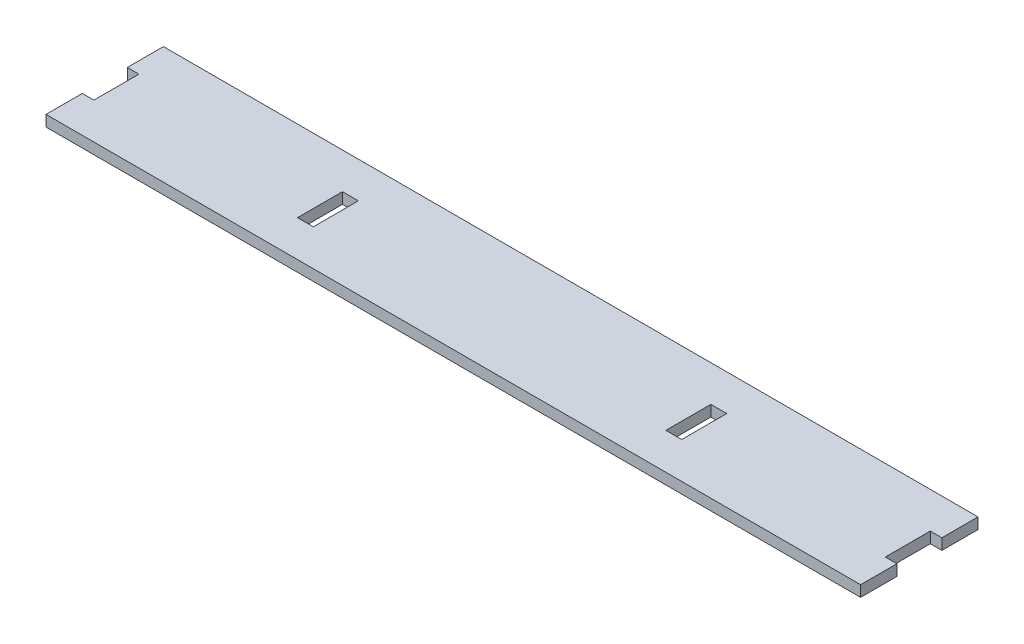
ISO-10303-21;
HEADER;
FILE_DESCRIPTION(('STEP AP214'),'2;1');
FILE_NAME('part.step','',(''),(''),'','','');
FILE_SCHEMA(('AUTOMOTIVE_DESIGN { 1 0 10303 214 1 1 1 1 }'));
ENDSEC;
DATA;
#1=APPLICATION_CONTEXT('core data for automotive mechanical design processes');
#2=APPLICATION_PROTOCOL_DEFINITION('international standard','automotive_design',2000,#1);
#3=PRODUCT_CONTEXT('',#1,'mechanical');
#4=PRODUCT('Part','Part','',(#3));
#5=PRODUCT_RELATED_PRODUCT_CATEGORY('part','',(#4));
#6=PRODUCT_DEFINITION_FORMATION('','',#4);
#7=PRODUCT_DEFINITION_CONTEXT('part definition',#1,'design');
#8=PRODUCT_DEFINITION('design','',#6,#7);
#9=PRODUCT_DEFINITION_SHAPE('','',#8);
#10=(LENGTH_UNIT() NAMED_UNIT(*) SI_UNIT(.MILLI.,.METRE.));
#11=(NAMED_UNIT(*) PLANE_ANGLE_UNIT() SI_UNIT($,.RADIAN.));
#12=(NAMED_UNIT(*) SI_UNIT($,.STERADIAN.) SOLID_ANGLE_UNIT());
#13=UNCERTAINTY_MEASURE_WITH_UNIT(LENGTH_MEASURE(1.E-05),#10,'distance_accuracy_value','');
#14=(GEOMETRIC_REPRESENTATION_CONTEXT(3) GLOBAL_UNCERTAINTY_ASSIGNED_CONTEXT((#13)) GLOBAL_UNIT_ASSIGNED_CONTEXT((#10,
#11,#12)) REPRESENTATION_CONTEXT('',''));
#15=CARTESIAN_POINT('',(0.,0.,0.));
#16=DIRECTION('',(0.,0.,1.));
#17=DIRECTION('',(1.,0.,0.));
#18=AXIS2_PLACEMENT_3D('',#15,#16,#17);
#19=CARTESIAN_POINT('',(-177.8,4.7625,25.4));
#20=DIRECTION('',(0.,0.,-1.));
#21=DIRECTION('',(-1.,0.,0.));
#22=AXIS2_PLACEMENT_3D('',#19,#20,#21);
#23=PLANE('',#22);
#24=DIRECTION('',(1.,0.,0.));
#25=VECTOR('',#24,1.);
#26=CARTESIAN_POINT('',(-177.8,0.,25.4));
#27=LINE('',#26,#25);
#28=CARTESIAN_POINT('',(-176.2125,0.,25.4));
#29=VERTEX_POINT('',#28);
#30=CARTESIAN_POINT('',(176.2125,0.,25.4));
#31=VERTEX_POINT('',#30);
#32=EDGE_CURVE('E271',#29,#31,#27,.T.);
#33=ORIENTED_EDGE('',*,*,#32,.T.);
#34=DIRECTION('',(0.,1.,0.));
#35=VECTOR('',#34,1.);
#36=CARTESIAN_POINT('',(176.2125,0.,25.4));
#37=LINE('',#36,#35);
#38=CARTESIAN_POINT('',(176.2125,4.7625,25.4));
#39=VERTEX_POINT('',#38);
#40=EDGE_CURVE('E247',#31,#39,#37,.T.);
#41=ORIENTED_EDGE('',*,*,#40,.T.);
#42=DIRECTION('',(1.,0.,0.));
#43=VECTOR('',#42,1.);
#44=CARTESIAN_POINT('',(-177.8,4.7625,25.4));
#45=LINE('',#44,#43);
#46=CARTESIAN_POINT('',(-176.2125,4.7625,25.4));
#47=VERTEX_POINT('',#46);
#48=EDGE_CURVE('E293',#47,#39,#45,.T.);
#49=ORIENTED_EDGE('',*,*,#48,.F.);
#50=DIRECTION('',(0.,1.,0.));
#51=VECTOR('',#50,1.);
#52=CARTESIAN_POINT('',(-176.2125,0.,25.4));
#53=LINE('',#52,#51);
#54=EDGE_CURVE('E266',#29,#47,#53,.T.);
#55=ORIENTED_EDGE('',*,*,#54,.F.);
#56=EDGE_LOOP('',(#33,#41,#49,#55));
#57=FACE_BOUND('',#56,.T.);
#58=ADVANCED_FACE('F35',(#57),#23,.F.);
#59=CARTESIAN_POINT('',(-177.8,4.7625,-25.4));
#60=DIRECTION('',(0.,0.,1.));
#61=DIRECTION('',(1.,0.,0.));
#62=AXIS2_PLACEMENT_3D('',#59,#60,#61);
#63=PLANE('',#62);
#64=DIRECTION('',(-1.,0.,0.));
#65=VECTOR('',#64,1.);
#66=CARTESIAN_POINT('',(-177.8,4.7625,-25.4));
#67=LINE('',#66,#65);
#68=CARTESIAN_POINT('',(176.2125,4.7625,-25.4));
#69=VERTEX_POINT('',#68);
#70=CARTESIAN_POINT('',(-176.2125,4.7625,-25.4));
#71=VERTEX_POINT('',#70);
#72=EDGE_CURVE('E287',#69,#71,#67,.T.);
#73=ORIENTED_EDGE('',*,*,#72,.F.);
#74=DIRECTION('',(0.,1.,0.));
#75=VECTOR('',#74,1.);
#76=CARTESIAN_POINT('',(176.2125,0.,-25.4));
#77=LINE('',#76,#75);
#78=CARTESIAN_POINT('',(176.2125,0.,-25.4));
#79=VERTEX_POINT('',#78);
#80=EDGE_CURVE('E235',#79,#69,#77,.T.);
#81=ORIENTED_EDGE('',*,*,#80,.F.);
#82=DIRECTION('',(-1.,0.,0.));
#83=VECTOR('',#82,1.);
#84=CARTESIAN_POINT('',(-177.8,0.,-25.4));
#85=LINE('',#84,#83);
#86=CARTESIAN_POINT('',(-176.2125,0.,-25.4));
#87=VERTEX_POINT('',#86);
#88=EDGE_CURVE('E311',#79,#87,#85,.T.);
#89=ORIENTED_EDGE('',*,*,#88,.T.);
#90=DIRECTION('',(0.,1.,0.));
#91=VECTOR('',#90,1.);
#92=CARTESIAN_POINT('',(-176.2125,0.,-25.4));
#93=LINE('',#92,#91);
#94=EDGE_CURVE('E258',#87,#71,#93,.T.);
#95=ORIENTED_EDGE('',*,*,#94,.T.);
#96=EDGE_LOOP('',(#73,#81,#89,#95));
#97=FACE_BOUND('',#96,.T.);
#98=ADVANCED_FACE('F350',(#97),#63,.F.);
#99=CARTESIAN_POINT('',(0.,4.7625,0.));
#100=DIRECTION('',(0.,1.,0.));
#101=DIRECTION('',(0.,0.,1.));
#102=AXIS2_PLACEMENT_3D('',#99,#100,#101);
#103=PLANE('',#102);
#104=DIRECTION('',(1.,0.,0.));
#105=VECTOR('',#104,1.);
#106=CARTESIAN_POINT('',(82.8039999999999,4.7625,-9.77900000000513));
#107=LINE('',#106,#105);
#108=CARTESIAN_POINT('',(76.2634999999999,4.7625,-9.77900000000513));
#109=VERTEX_POINT('',#108);
#110=CARTESIAN_POINT('',(83.1214999999999,4.7625,-9.77900000000515));
#111=VERTEX_POINT('',#110);
#112=EDGE_CURVE('E52',#109,#111,#107,.T.);
#113=ORIENTED_EDGE('',*,*,#112,.T.);
#114=DIRECTION('',(0.,0.,-1.));
#115=VECTOR('',#114,1.);
#116=CARTESIAN_POINT('',(83.1214999999999,4.7625,-9.77900000000515));
#117=LINE('',#116,#115);
#118=CARTESIAN_POINT('',(83.1214999999999,4.7625,9.6923213213589));
#119=VERTEX_POINT('',#118);
#120=EDGE_CURVE('E196',#119,#111,#117,.T.);
#121=ORIENTED_EDGE('',*,*,#120,.F.);
#122=DIRECTION('',(-1.,0.,0.));
#123=VECTOR('',#122,1.);
#124=CARTESIAN_POINT('',(82.8039999999999,4.7625,9.6923213213589));
#125=LINE('',#124,#123);
#126=CARTESIAN_POINT('',(76.2634999999999,4.7625,9.6923213213589));
#127=VERTEX_POINT('',#126);
#128=EDGE_CURVE('E188',#119,#127,#125,.T.);
#129=ORIENTED_EDGE('',*,*,#128,.T.);
#130=DIRECTION('',(0.,0.,-1.));
#131=VECTOR('',#130,1.);
#132=CARTESIAN_POINT('',(76.2634999999999,4.7625,-9.77900000000513));
#133=LINE('',#132,#131);
#134=EDGE_CURVE('E211',#127,#109,#133,.T.);
#135=ORIENTED_EDGE('',*,*,#134,.T.);
#136=EDGE_LOOP('',(#113,#121,#129,#135));
#137=FACE_BOUND('',#136,.T.);
#138=DIRECTION('',(-1.,0.,0.));
#139=VECTOR('',#138,1.);
#140=CARTESIAN_POINT('',(-75.9460000000001,4.7625,9.6923213213589));
#141=LINE('',#140,#139);
#142=CARTESIAN_POINT('',(-76.2635000000001,4.7625,9.6923213213589));
#143=VERTEX_POINT('',#142);
#144=CARTESIAN_POINT('',(-83.1215000000001,4.7625,9.6923213213589));
#145=VERTEX_POINT('',#144);
#146=EDGE_CURVE('E277',#143,#145,#141,.T.);
#147=ORIENTED_EDGE('',*,*,#146,.T.);
#148=DIRECTION('',(0.,0.,1.));
#149=VECTOR('',#148,1.);
#150=CARTESIAN_POINT('',(-83.1215000000001,4.7625,-9.77900000000513));
#151=LINE('',#150,#149);
#152=CARTESIAN_POINT('',(-83.1215000000001,4.7625,-9.77900000000513));
#153=VERTEX_POINT('',#152);
#154=EDGE_CURVE('E200',#153,#145,#151,.T.);
#155=ORIENTED_EDGE('',*,*,#154,.F.);
#156=DIRECTION('',(1.,0.,0.));
#157=VECTOR('',#156,1.);
#158=CARTESIAN_POINT('',(-75.9460000000001,4.7625,-9.77900000000513));
#159=LINE('',#158,#157);
#160=CARTESIAN_POINT('',(-76.2635000000001,4.7625,-9.77900000000513));
#161=VERTEX_POINT('',#160);
#162=EDGE_CURVE('E281',#153,#161,#159,.T.);
#163=ORIENTED_EDGE('',*,*,#162,.T.);
#164=DIRECTION('',(0.,0.,1.));
#165=VECTOR('',#164,1.);
#166=CARTESIAN_POINT('',(-76.2635000000001,4.7625,-9.77900000000513));
#167=LINE('',#166,#165);
#168=EDGE_CURVE('E215',#161,#143,#167,.T.);
#169=ORIENTED_EDGE('',*,*,#168,.T.);
#170=EDGE_LOOP('',(#147,#155,#163,#169));
#171=FACE_BOUND('',#170,.T.);
#172=DIRECTION('',(0.,0.,1.));
#173=VECTOR('',#172,1.);
#174=CARTESIAN_POINT('',(176.2125,4.7625,0.));
#175=LINE('',#174,#173);
#176=CARTESIAN_POINT('',(176.2125,4.7625,-9.77900000000509));
#177=VERTEX_POINT('',#176);
#178=EDGE_CURVE('E224',#69,#177,#175,.T.);
#179=ORIENTED_EDGE('',*,*,#178,.F.);
#180=ORIENTED_EDGE('',*,*,#72,.T.);
#181=DIRECTION('',(0.,0.,-1.));
#182=VECTOR('',#181,1.);
#183=CARTESIAN_POINT('',(-176.2125,4.7625,0.));
#184=LINE('',#183,#182);
#185=CARTESIAN_POINT('',(-176.2125,4.7625,-9.77900000000513));
#186=VERTEX_POINT('',#185);
#187=EDGE_CURVE('E250',#186,#71,#184,.T.);
#188=ORIENTED_EDGE('',*,*,#187,.F.);
#189=DIRECTION('',(1.,0.,0.));
#190=VECTOR('',#189,1.);
#191=CARTESIAN_POINT('',(-171.196,4.7625,-9.77900000000513));
#192=LINE('',#191,#190);
#193=CARTESIAN_POINT('',(-171.196,4.7625,-9.77900000000513));
#194=VERTEX_POINT('',#193);
#195=EDGE_CURVE('E284',#186,#194,#192,.T.);
#196=ORIENTED_EDGE('',*,*,#195,.T.);
#197=DIRECTION('',(0.,0.,1.));
#198=VECTOR('',#197,1.);
#199=CARTESIAN_POINT('',(-171.196,4.7625,-9.77900000000513));
#200=LINE('',#199,#198);
#201=CARTESIAN_POINT('',(-171.196,4.7625,9.69232132137164));
#202=VERTEX_POINT('',#201);
#203=EDGE_CURVE('E286',#194,#202,#200,.T.);
#204=ORIENTED_EDGE('',*,*,#203,.T.);
#205=DIRECTION('',(-1.,0.,0.));
#206=VECTOR('',#205,1.);
#207=CARTESIAN_POINT('',(-171.196,4.7625,9.69232132137164));
#208=LINE('',#207,#206);
#209=CARTESIAN_POINT('',(-176.2125,4.7625,9.69232132137164));
#210=VERTEX_POINT('',#209);
#211=EDGE_CURVE('E290',#202,#210,#208,.T.);
#212=ORIENTED_EDGE('',*,*,#211,.T.);
#213=DIRECTION('',(0.,0.,-1.));
#214=VECTOR('',#213,1.);
#215=CARTESIAN_POINT('',(-176.2125,4.7625,0.));
#216=LINE('',#215,#214);
#217=EDGE_CURVE('E261',#47,#210,#216,.T.);
#218=ORIENTED_EDGE('',*,*,#217,.F.);
#219=ORIENTED_EDGE('',*,*,#48,.T.);
#220=DIRECTION('',(0.,0.,1.));
#221=VECTOR('',#220,1.);
#222=CARTESIAN_POINT('',(176.2125,4.7625,0.));
#223=LINE('',#222,#221);
#224=CARTESIAN_POINT('',(176.2125,4.7625,9.6923213213589));
#225=VERTEX_POINT('',#224);
#226=EDGE_CURVE('E240',#225,#39,#223,.T.);
#227=ORIENTED_EDGE('',*,*,#226,.F.);
#228=DIRECTION('',(-1.,0.,0.));
#229=VECTOR('',#228,1.);
#230=CARTESIAN_POINT('',(171.196,4.7625,9.6923213213589));
#231=LINE('',#230,#229);
#232=CARTESIAN_POINT('',(171.196,4.7625,9.6923213213589));
#233=VERTEX_POINT('',#232);
#234=EDGE_CURVE('E307',#225,#233,#231,.T.);
#235=ORIENTED_EDGE('',*,*,#234,.T.);
#236=DIRECTION('',(0.,0.,-1.));
#237=VECTOR('',#236,1.);
#238=CARTESIAN_POINT('',(171.196,4.7625,-9.77900000000509));
#239=LINE('',#238,#237);
#240=CARTESIAN_POINT('',(171.196,4.7625,-9.77900000000509));
#241=VERTEX_POINT('',#240);
#242=EDGE_CURVE('E279',#233,#241,#239,.T.);
#243=ORIENTED_EDGE('',*,*,#242,.T.);
#244=DIRECTION('',(1.,0.,0.));
#245=VECTOR('',#244,1.);
#246=CARTESIAN_POINT('',(171.196,4.7625,-9.77900000000509));
#247=LINE('',#246,#245);
#248=EDGE_CURVE('E39',#241,#177,#247,.T.);
#249=ORIENTED_EDGE('',*,*,#248,.T.);
#250=EDGE_LOOP('',(#179,#180,#188,#196,#204,#212,#218,#219,#227,#235,#243,#249));
#251=FACE_BOUND('',#250,.T.);
#252=ADVANCED_FACE('F332',(#137,#171,#251),#103,.T.);
#253=CARTESIAN_POINT('',(0.,0.,0.));
#254=DIRECTION('',(0.,1.,0.));
#255=DIRECTION('',(0.,0.,1.));
#256=AXIS2_PLACEMENT_3D('',#253,#254,#255);
#257=PLANE('',#256);
#258=DIRECTION('',(0.,0.,-1.));
#259=VECTOR('',#258,1.);
#260=CARTESIAN_POINT('',(83.1214999999999,0.,-9.77900000000515));
#261=LINE('',#260,#259);
#262=CARTESIAN_POINT('',(83.1214999999999,0.,9.6923213213589));
#263=VERTEX_POINT('',#262);
#264=CARTESIAN_POINT('',(83.1214999999999,0.,-9.77900000000515));
#265=VERTEX_POINT('',#264);
#266=EDGE_CURVE('E176',#263,#265,#261,.T.);
#267=ORIENTED_EDGE('',*,*,#266,.T.);
#268=DIRECTION('',(1.,0.,0.));
#269=VECTOR('',#268,1.);
#270=CARTESIAN_POINT('',(82.8039999999999,0.,-9.77900000000513));
#271=LINE('',#270,#269);
#272=CARTESIAN_POINT('',(76.2634999999999,0.,-9.77900000000513));
#273=VERTEX_POINT('',#272);
#274=EDGE_CURVE('E182',#273,#265,#271,.T.);
#275=ORIENTED_EDGE('',*,*,#274,.F.);
#276=DIRECTION('',(0.,0.,1.));
#277=VECTOR('',#276,1.);
#278=CARTESIAN_POINT('',(76.2634999999999,0.,-9.77900000000513));
#279=LINE('',#278,#277);
#280=CARTESIAN_POINT('',(76.2634999999999,0.,9.6923213213589));
#281=VERTEX_POINT('',#280);
#282=EDGE_CURVE('E178',#273,#281,#279,.T.);
#283=ORIENTED_EDGE('',*,*,#282,.T.);
#284=DIRECTION('',(-1.,0.,0.));
#285=VECTOR('',#284,1.);
#286=CARTESIAN_POINT('',(82.8039999999999,0.,9.6923213213589));
#287=LINE('',#286,#285);
#288=EDGE_CURVE('E172',#263,#281,#287,.T.);
#289=ORIENTED_EDGE('',*,*,#288,.F.);
#290=EDGE_LOOP('',(#267,#275,#283,#289));
#291=FACE_BOUND('',#290,.T.);
#292=DIRECTION('',(0.,0.,1.));
#293=VECTOR('',#292,1.);
#294=CARTESIAN_POINT('',(-83.1215000000001,0.,-9.77900000000513));
#295=LINE('',#294,#293);
#296=CARTESIAN_POINT('',(-83.1215000000001,0.,-9.77900000000513));
#297=VERTEX_POINT('',#296);
#298=CARTESIAN_POINT('',(-83.1215000000001,0.,9.6923213213589));
#299=VERTEX_POINT('',#298);
#300=EDGE_CURVE('E202',#297,#299,#295,.T.);
#301=ORIENTED_EDGE('',*,*,#300,.T.);
#302=DIRECTION('',(-1.,0.,0.));
#303=VECTOR('',#302,1.);
#304=CARTESIAN_POINT('',(-75.9460000000001,0.,9.6923213213589));
#305=LINE('',#304,#303);
#306=CARTESIAN_POINT('',(-76.2635000000001,0.,9.6923213213589));
#307=VERTEX_POINT('',#306);
#308=EDGE_CURVE('E282',#307,#299,#305,.T.);
#309=ORIENTED_EDGE('',*,*,#308,.F.);
#310=DIRECTION('',(0.,0.,-1.));
#311=VECTOR('',#310,1.);
#312=CARTESIAN_POINT('',(-76.2635000000001,0.,-9.77900000000513));
#313=LINE('',#312,#311);
#314=CARTESIAN_POINT('',(-76.2635000000001,0.,-9.77900000000513));
#315=VERTEX_POINT('',#314);
#316=EDGE_CURVE('E221',#307,#315,#313,.T.);
#317=ORIENTED_EDGE('',*,*,#316,.T.);
#318=DIRECTION('',(1.,0.,0.));
#319=VECTOR('',#318,1.);
#320=CARTESIAN_POINT('',(-75.9460000000001,0.,-9.77900000000513));
#321=LINE('',#320,#319);
#322=EDGE_CURVE('E304',#297,#315,#321,.T.);
#323=ORIENTED_EDGE('',*,*,#322,.F.);
#324=EDGE_LOOP('',(#301,#309,#317,#323));
#325=FACE_BOUND('',#324,.T.);
#326=ORIENTED_EDGE('',*,*,#88,.F.);
#327=DIRECTION('',(0.,0.,1.));
#328=VECTOR('',#327,1.);
#329=CARTESIAN_POINT('',(176.2125,0.,0.));
#330=LINE('',#329,#328);
#331=CARTESIAN_POINT('',(176.2125,0.,-9.77900000000509));
#332=VERTEX_POINT('',#331);
#333=EDGE_CURVE('E232',#79,#332,#330,.T.);
#334=ORIENTED_EDGE('',*,*,#333,.T.);
#335=DIRECTION('',(1.,0.,0.));
#336=VECTOR('',#335,1.);
#337=CARTESIAN_POINT('',(171.196,0.,-9.77900000000509));
#338=LINE('',#337,#336);
#339=CARTESIAN_POINT('',(171.196,0.,-9.77900000000509));
#340=VERTEX_POINT('',#339);
#341=EDGE_CURVE('E321',#340,#332,#338,.T.);
#342=ORIENTED_EDGE('',*,*,#341,.F.);
#343=DIRECTION('',(0.,0.,-1.));
#344=VECTOR('',#343,1.);
#345=CARTESIAN_POINT('',(171.196,0.,-9.77900000000509));
#346=LINE('',#345,#344);
#347=CARTESIAN_POINT('',(171.196,0.,9.6923213213589));
#348=VERTEX_POINT('',#347);
#349=EDGE_CURVE('E44',#348,#340,#346,.T.);
#350=ORIENTED_EDGE('',*,*,#349,.F.);
#351=DIRECTION('',(1.,0.,0.));
#352=VECTOR('',#351,1.);
#353=CARTESIAN_POINT('',(0.,0.,9.69232132135886));
#354=LINE('',#353,#352);
#355=CARTESIAN_POINT('',(176.2125,0.,9.6923213213589));
#356=VERTEX_POINT('',#355);
#357=EDGE_CURVE('E273',#348,#356,#354,.T.);
#358=ORIENTED_EDGE('',*,*,#357,.T.);
#359=DIRECTION('',(0.,0.,1.));
#360=VECTOR('',#359,1.);
#361=CARTESIAN_POINT('',(176.2125,0.,0.));
#362=LINE('',#361,#360);
#363=EDGE_CURVE('E242',#356,#31,#362,.T.);
#364=ORIENTED_EDGE('',*,*,#363,.T.);
#365=ORIENTED_EDGE('',*,*,#32,.F.);
#366=DIRECTION('',(0.,0.,-1.));
#367=VECTOR('',#366,1.);
#368=CARTESIAN_POINT('',(-176.2125,0.,0.));
#369=LINE('',#368,#367);
#370=CARTESIAN_POINT('',(-176.2125,0.,9.69232132137164));
#371=VERTEX_POINT('',#370);
#372=EDGE_CURVE('E263',#29,#371,#369,.T.);
#373=ORIENTED_EDGE('',*,*,#372,.T.);
#374=DIRECTION('',(-1.,0.,0.));
#375=VECTOR('',#374,1.);
#376=CARTESIAN_POINT('',(-171.196,0.,9.69232132137164));
#377=LINE('',#376,#375);
#378=CARTESIAN_POINT('',(-171.196,0.,9.69232132137164));
#379=VERTEX_POINT('',#378);
#380=EDGE_CURVE('E298',#379,#371,#377,.T.);
#381=ORIENTED_EDGE('',*,*,#380,.F.);
#382=DIRECTION('',(0.,0.,1.));
#383=VECTOR('',#382,1.);
#384=CARTESIAN_POINT('',(-171.196,0.,-9.77900000000513));
#385=LINE('',#384,#383);
#386=CARTESIAN_POINT('',(-171.196,0.,-9.77900000000513));
#387=VERTEX_POINT('',#386);
#388=EDGE_CURVE('E294',#387,#379,#385,.T.);
#389=ORIENTED_EDGE('',*,*,#388,.F.);
#390=DIRECTION('',(-1.,0.,0.));
#391=VECTOR('',#390,1.);
#392=CARTESIAN_POINT('',(0.,0.,-9.77900000000513));
#393=LINE('',#392,#391);
#394=CARTESIAN_POINT('',(-176.2125,0.,-9.77900000000513));
#395=VERTEX_POINT('',#394);
#396=EDGE_CURVE('E276',#387,#395,#393,.T.);
#397=ORIENTED_EDGE('',*,*,#396,.T.);
#398=DIRECTION('',(0.,0.,-1.));
#399=VECTOR('',#398,1.);
#400=CARTESIAN_POINT('',(-176.2125,0.,0.));
#401=LINE('',#400,#399);
#402=EDGE_CURVE('E252',#395,#87,#401,.T.);
#403=ORIENTED_EDGE('',*,*,#402,.T.);
#404=EDGE_LOOP('',(#326,#334,#342,#350,#358,#364,#365,#373,#381,#389,#397,#403));
#405=FACE_BOUND('',#404,.T.);
#406=ADVANCED_FACE('F37',(#291,#325,#405),#257,.F.);
#407=CARTESIAN_POINT('',(-171.196,4.7625,-9.77900000000513));
#408=DIRECTION('',(0.,0.,-1.));
#409=DIRECTION('',(-1.,0.,0.));
#410=AXIS2_PLACEMENT_3D('',#407,#408,#409);
#411=PLANE('',#410);
#412=ORIENTED_EDGE('',*,*,#195,.F.);
#413=DIRECTION('',(0.,1.,0.));
#414=VECTOR('',#413,1.);
#415=CARTESIAN_POINT('',(-176.2125,0.,-9.77900000000513));
#416=LINE('',#415,#414);
#417=EDGE_CURVE('E255',#395,#186,#416,.T.);
#418=ORIENTED_EDGE('',*,*,#417,.F.);
#419=ORIENTED_EDGE('',*,*,#396,.F.);
#420=DIRECTION('',(0.,-1.,0.));
#421=VECTOR('',#420,1.);
#422=CARTESIAN_POINT('',(-171.196,4.7625,-9.77900000000513));
#423=LINE('',#422,#421);
#424=EDGE_CURVE('E297',#194,#387,#423,.T.);
#425=ORIENTED_EDGE('',*,*,#424,.F.);
#426=EDGE_LOOP('',(#412,#418,#419,#425));
#427=FACE_BOUND('',#426,.T.);
#428=ADVANCED_FACE('F363',(#427),#411,.F.);
#429=CARTESIAN_POINT('',(-171.196,4.7625,9.69232132137164));
#430=DIRECTION('',(0.,0.,1.));
#431=DIRECTION('',(1.,0.,0.));
#432=AXIS2_PLACEMENT_3D('',#429,#430,#431);
#433=PLANE('',#432);
#434=ORIENTED_EDGE('',*,*,#380,.T.);
#435=DIRECTION('',(0.,1.,0.));
#436=VECTOR('',#435,1.);
#437=CARTESIAN_POINT('',(-176.2125,0.,9.69232132137164));
#438=LINE('',#437,#436);
#439=EDGE_CURVE('E268',#371,#210,#438,.T.);
#440=ORIENTED_EDGE('',*,*,#439,.T.);
#441=ORIENTED_EDGE('',*,*,#211,.F.);
#442=DIRECTION('',(0.,-1.,0.));
#443=VECTOR('',#442,1.);
#444=CARTESIAN_POINT('',(-171.196,4.7625,9.69232132137164));
#445=LINE('',#444,#443);
#446=EDGE_CURVE('E301',#202,#379,#445,.T.);
#447=ORIENTED_EDGE('',*,*,#446,.T.);
#448=EDGE_LOOP('',(#434,#440,#441,#447));
#449=FACE_BOUND('',#448,.T.);
#450=ADVANCED_FACE('F370',(#449),#433,.F.);
#451=CARTESIAN_POINT('',(-171.196,4.7625,-9.77900000000513));
#452=DIRECTION('',(1.,0.,0.));
#453=DIRECTION('',(0.,0.,-1.));
#454=AXIS2_PLACEMENT_3D('',#451,#452,#453);
#455=PLANE('',#454);
#456=ORIENTED_EDGE('',*,*,#388,.T.);
#457=ORIENTED_EDGE('',*,*,#446,.F.);
#458=ORIENTED_EDGE('',*,*,#203,.F.);
#459=ORIENTED_EDGE('',*,*,#424,.T.);
#460=EDGE_LOOP('',(#456,#457,#458,#459));
#461=FACE_BOUND('',#460,.T.);
#462=ADVANCED_FACE('F368',(#461),#455,.F.);
#463=CARTESIAN_POINT('',(-75.9460000000001,4.7625,-9.77900000000513));
#464=DIRECTION('',(0.,0.,-1.));
#465=DIRECTION('',(-1.,0.,0.));
#466=AXIS2_PLACEMENT_3D('',#463,#464,#465);
#467=PLANE('',#466);
#468=ORIENTED_EDGE('',*,*,#322,.T.);
#469=DIRECTION('',(0.,1.,0.));
#470=VECTOR('',#469,1.);
#471=CARTESIAN_POINT('',(-76.2635000000001,-19.4739097319928,-9.77900000000513));
#472=LINE('',#471,#470);
#473=EDGE_CURVE('E228',#315,#161,#472,.T.);
#474=ORIENTED_EDGE('',*,*,#473,.T.);
#475=ORIENTED_EDGE('',*,*,#162,.F.);
#476=DIRECTION('',(0.,1.,0.));
#477=VECTOR('',#476,1.);
#478=CARTESIAN_POINT('',(-83.1215000000001,0.,-9.77900000000513));
#479=LINE('',#478,#477);
#480=EDGE_CURVE('E205',#297,#153,#479,.T.);
#481=ORIENTED_EDGE('',*,*,#480,.F.);
#482=EDGE_LOOP('',(#468,#474,#475,#481));
#483=FACE_BOUND('',#482,.T.);
#484=ADVANCED_FACE('F400',(#483),#467,.F.);
#485=CARTESIAN_POINT('',(-75.9460000000001,4.7625,9.6923213213589));
#486=DIRECTION('',(0.,0.,1.));
#487=DIRECTION('',(1.,0.,0.));
#488=AXIS2_PLACEMENT_3D('',#485,#486,#487);
#489=PLANE('',#488);
#490=ORIENTED_EDGE('',*,*,#146,.F.);
#491=DIRECTION('',(0.,1.,0.));
#492=VECTOR('',#491,1.);
#493=CARTESIAN_POINT('',(-76.2635000000001,-19.4739097319928,9.6923213213589));
#494=LINE('',#493,#492);
#495=EDGE_CURVE('E225',#307,#143,#494,.T.);
#496=ORIENTED_EDGE('',*,*,#495,.F.);
#497=ORIENTED_EDGE('',*,*,#308,.T.);
#498=DIRECTION('',(0.,1.,0.));
#499=VECTOR('',#498,1.);
#500=CARTESIAN_POINT('',(-83.1215000000001,0.,9.6923213213589));
#501=LINE('',#500,#499);
#502=EDGE_CURVE('E208',#299,#145,#501,.T.);
#503=ORIENTED_EDGE('',*,*,#502,.T.);
#504=EDGE_LOOP('',(#490,#496,#497,#503));
#505=FACE_BOUND('',#504,.T.);
#506=ADVANCED_FACE('F403',(#505),#489,.F.);
#507=CARTESIAN_POINT('',(82.8039999999999,4.7625,-9.77900000000513));
#508=DIRECTION('',(0.,0.,-1.));
#509=DIRECTION('',(-1.,0.,0.));
#510=AXIS2_PLACEMENT_3D('',#507,#508,#509);
#511=PLANE('',#510);
#512=ORIENTED_EDGE('',*,*,#112,.F.);
#513=DIRECTION('',(0.,1.,0.));
#514=VECTOR('',#513,1.);
#515=CARTESIAN_POINT('',(76.2634999999999,-19.4739097319928,-9.77900000000513));
#516=LINE('',#515,#514);
#517=EDGE_CURVE('E56',#273,#109,#516,.T.);
#518=ORIENTED_EDGE('',*,*,#517,.F.);
#519=ORIENTED_EDGE('',*,*,#274,.T.);
#520=DIRECTION('',(0.,1.,0.));
#521=VECTOR('',#520,1.);
#522=CARTESIAN_POINT('',(83.1214999999999,0.,-9.77900000000515));
#523=LINE('',#522,#521);
#524=EDGE_CURVE('E192',#265,#111,#523,.T.);
#525=ORIENTED_EDGE('',*,*,#524,.T.);
#526=EDGE_LOOP('',(#512,#518,#519,#525));
#527=FACE_BOUND('',#526,.T.);
#528=ADVANCED_FACE('F407',(#527),#511,.F.);
#529=CARTESIAN_POINT('',(82.8039999999999,4.7625,9.6923213213589));
#530=DIRECTION('',(0.,0.,1.));
#531=DIRECTION('',(1.,0.,0.));
#532=AXIS2_PLACEMENT_3D('',#529,#530,#531);
#533=PLANE('',#532);
#534=ORIENTED_EDGE('',*,*,#288,.T.);
#535=DIRECTION('',(0.,1.,0.));
#536=VECTOR('',#535,1.);
#537=CARTESIAN_POINT('',(76.2634999999999,-19.4739097319928,9.6923213213589));
#538=LINE('',#537,#536);
#539=EDGE_CURVE('E218',#281,#127,#538,.T.);
#540=ORIENTED_EDGE('',*,*,#539,.T.);
#541=ORIENTED_EDGE('',*,*,#128,.F.);
#542=DIRECTION('',(0.,1.,0.));
#543=VECTOR('',#542,1.);
#544=CARTESIAN_POINT('',(83.1214999999999,0.,9.6923213213589));
#545=LINE('',#544,#543);
#546=EDGE_CURVE('E185',#263,#119,#545,.T.);
#547=ORIENTED_EDGE('',*,*,#546,.F.);
#548=EDGE_LOOP('',(#534,#540,#541,#547));
#549=FACE_BOUND('',#548,.T.);
#550=ADVANCED_FACE('F186',(#549),#533,.F.);
#551=CARTESIAN_POINT('',(171.196,4.7625,-9.77900000000509));
#552=DIRECTION('',(0.,0.,-1.));
#553=DIRECTION('',(-1.,0.,0.));
#554=AXIS2_PLACEMENT_3D('',#551,#552,#553);
#555=PLANE('',#554);
#556=ORIENTED_EDGE('',*,*,#341,.T.);
#557=DIRECTION('',(0.,1.,0.));
#558=VECTOR('',#557,1.);
#559=CARTESIAN_POINT('',(176.2125,0.,-9.77900000000509));
#560=LINE('',#559,#558);
#561=EDGE_CURVE('E237',#332,#177,#560,.T.);
#562=ORIENTED_EDGE('',*,*,#561,.T.);
#563=ORIENTED_EDGE('',*,*,#248,.F.);
#564=DIRECTION('',(0.,-1.,0.));
#565=VECTOR('',#564,1.);
#566=CARTESIAN_POINT('',(171.196,4.7625,-9.77900000000509));
#567=LINE('',#566,#565);
#568=EDGE_CURVE('E181',#241,#340,#567,.T.);
#569=ORIENTED_EDGE('',*,*,#568,.T.);
#570=EDGE_LOOP('',(#556,#562,#563,#569));
#571=FACE_BOUND('',#570,.T.);
#572=ADVANCED_FACE('F344',(#571),#555,.F.);
#573=CARTESIAN_POINT('',(171.196,4.7625,9.6923213213589));
#574=DIRECTION('',(0.,0.,1.));
#575=DIRECTION('',(1.,0.,0.));
#576=AXIS2_PLACEMENT_3D('',#573,#574,#575);
#577=PLANE('',#576);
#578=ORIENTED_EDGE('',*,*,#234,.F.);
#579=DIRECTION('',(0.,1.,0.));
#580=VECTOR('',#579,1.);
#581=CARTESIAN_POINT('',(176.2125,0.,9.6923213213589));
#582=LINE('',#581,#580);
#583=EDGE_CURVE('E245',#356,#225,#582,.T.);
#584=ORIENTED_EDGE('',*,*,#583,.F.);
#585=ORIENTED_EDGE('',*,*,#357,.F.);
#586=DIRECTION('',(0.,-1.,0.));
#587=VECTOR('',#586,1.);
#588=CARTESIAN_POINT('',(171.196,4.7625,9.6923213213589));
#589=LINE('',#588,#587);
#590=EDGE_CURVE('E11',#233,#348,#589,.T.);
#591=ORIENTED_EDGE('',*,*,#590,.F.);
#592=EDGE_LOOP('',(#578,#584,#585,#591));
#593=FACE_BOUND('',#592,.T.);
#594=ADVANCED_FACE('F337',(#593),#577,.F.);
#595=CARTESIAN_POINT('',(171.196,4.7625,-9.77900000000509));
#596=DIRECTION('',(-1.,0.,0.));
#597=DIRECTION('',(0.,0.,1.));
#598=AXIS2_PLACEMENT_3D('',#595,#596,#597);
#599=PLANE('',#598);
#600=ORIENTED_EDGE('',*,*,#349,.T.);
#601=ORIENTED_EDGE('',*,*,#568,.F.);
#602=ORIENTED_EDGE('',*,*,#242,.F.);
#603=ORIENTED_EDGE('',*,*,#590,.T.);
#604=EDGE_LOOP('',(#600,#601,#602,#603));
#605=FACE_BOUND('',#604,.T.);
#606=ADVANCED_FACE('F340',(#605),#599,.F.);
#607=CARTESIAN_POINT('',(-176.2125,0.,0.));
#608=DIRECTION('',(1.,0.,0.));
#609=DIRECTION('',(0.,0.,-1.));
#610=AXIS2_PLACEMENT_3D('',#607,#608,#609);
#611=PLANE('',#610);
#612=ORIENTED_EDGE('',*,*,#217,.T.);
#613=ORIENTED_EDGE('',*,*,#439,.F.);
#614=ORIENTED_EDGE('',*,*,#372,.F.);
#615=ORIENTED_EDGE('',*,*,#54,.T.);
#616=EDGE_LOOP('',(#612,#613,#614,#615));
#617=FACE_BOUND('',#616,.T.);
#618=ADVANCED_FACE('F372',(#617),#611,.F.);
#619=CARTESIAN_POINT('',(-176.2125,0.,0.));
#620=DIRECTION('',(1.,0.,0.));
#621=DIRECTION('',(0.,0.,-1.));
#622=AXIS2_PLACEMENT_3D('',#619,#620,#621);
#623=PLANE('',#622);
#624=ORIENTED_EDGE('',*,*,#187,.T.);
#625=ORIENTED_EDGE('',*,*,#94,.F.);
#626=ORIENTED_EDGE('',*,*,#402,.F.);
#627=ORIENTED_EDGE('',*,*,#417,.T.);
#628=EDGE_LOOP('',(#624,#625,#626,#627));
#629=FACE_BOUND('',#628,.T.);
#630=ADVANCED_FACE('F354',(#629),#623,.F.);
#631=CARTESIAN_POINT('',(176.2125,0.,0.));
#632=DIRECTION('',(-1.,0.,0.));
#633=DIRECTION('',(0.,0.,1.));
#634=AXIS2_PLACEMENT_3D('',#631,#632,#633);
#635=PLANE('',#634);
#636=ORIENTED_EDGE('',*,*,#226,.T.);
#637=ORIENTED_EDGE('',*,*,#40,.F.);
#638=ORIENTED_EDGE('',*,*,#363,.F.);
#639=ORIENTED_EDGE('',*,*,#583,.T.);
#640=EDGE_LOOP('',(#636,#637,#638,#639));
#641=FACE_BOUND('',#640,.T.);
#642=ADVANCED_FACE('F378',(#641),#635,.F.);
#643=CARTESIAN_POINT('',(176.2125,0.,0.));
#644=DIRECTION('',(-1.,0.,0.));
#645=DIRECTION('',(0.,0.,1.));
#646=AXIS2_PLACEMENT_3D('',#643,#644,#645);
#647=PLANE('',#646);
#648=ORIENTED_EDGE('',*,*,#178,.T.);
#649=ORIENTED_EDGE('',*,*,#561,.F.);
#650=ORIENTED_EDGE('',*,*,#333,.F.);
#651=ORIENTED_EDGE('',*,*,#80,.T.);
#652=EDGE_LOOP('',(#648,#649,#650,#651));
#653=FACE_BOUND('',#652,.T.);
#654=ADVANCED_FACE('F379',(#653),#647,.F.);
#655=CARTESIAN_POINT('',(-76.2635000000001,-19.4739097319928,-9.77900000000513));
#656=DIRECTION('',(-1.,0.,0.));
#657=DIRECTION('',(0.,0.,1.));
#658=AXIS2_PLACEMENT_3D('',#655,#656,#657);
#659=PLANE('',#658);
#660=ORIENTED_EDGE('',*,*,#316,.F.);
#661=ORIENTED_EDGE('',*,*,#495,.T.);
#662=ORIENTED_EDGE('',*,*,#168,.F.);
#663=ORIENTED_EDGE('',*,*,#473,.F.);
#664=EDGE_LOOP('',(#660,#661,#662,#663));
#665=FACE_BOUND('',#664,.T.);
#666=ADVANCED_FACE('F381',(#665),#659,.T.);
#667=CARTESIAN_POINT('',(76.2634999999999,-19.4739097319928,-9.77900000000513));
#668=DIRECTION('',(1.,0.,0.));
#669=DIRECTION('',(0.,0.,-1.));
#670=AXIS2_PLACEMENT_3D('',#667,#668,#669);
#671=PLANE('',#670);
#672=ORIENTED_EDGE('',*,*,#282,.F.);
#673=ORIENTED_EDGE('',*,*,#517,.T.);
#674=ORIENTED_EDGE('',*,*,#134,.F.);
#675=ORIENTED_EDGE('',*,*,#539,.F.);
#676=EDGE_LOOP('',(#672,#673,#674,#675));
#677=FACE_BOUND('',#676,.T.);
#678=ADVANCED_FACE('F387',(#677),#671,.T.);
#679=CARTESIAN_POINT('',(-83.1215000000001,0.,-9.77900000000513));
#680=DIRECTION('',(-1.,0.,0.));
#681=DIRECTION('',(0.,0.,1.));
#682=AXIS2_PLACEMENT_3D('',#679,#680,#681);
#683=PLANE('',#682);
#684=ORIENTED_EDGE('',*,*,#154,.T.);
#685=ORIENTED_EDGE('',*,*,#502,.F.);
#686=ORIENTED_EDGE('',*,*,#300,.F.);
#687=ORIENTED_EDGE('',*,*,#480,.T.);
#688=EDGE_LOOP('',(#684,#685,#686,#687));
#689=FACE_BOUND('',#688,.T.);
#690=ADVANCED_FACE('F427',(#689),#683,.F.);
#691=CARTESIAN_POINT('',(83.1214999999999,0.,-9.77900000000515));
#692=DIRECTION('',(1.,0.,0.));
#693=DIRECTION('',(0.,0.,-1.));
#694=AXIS2_PLACEMENT_3D('',#691,#692,#693);
#695=PLANE('',#694);
#696=ORIENTED_EDGE('',*,*,#120,.T.);
#697=ORIENTED_EDGE('',*,*,#524,.F.);
#698=ORIENTED_EDGE('',*,*,#266,.F.);
#699=ORIENTED_EDGE('',*,*,#546,.T.);
#700=EDGE_LOOP('',(#696,#697,#698,#699));
#701=FACE_BOUND('',#700,.T.);
#702=ADVANCED_FACE('F195',(#701),#695,.F.);
#703=CLOSED_SHELL('',(#58,#98,#252,#406,#428,#450,#462,#484,#506,#528,#550,#572,#594,#606,#618,
#630,#642,#654,#666,#678,#690,#702));
#704=MANIFOLD_SOLID_BREP('B2',#703);
#705=ADVANCED_BREP_SHAPE_REPRESENTATION('',(#18,#704),#14);
#706=SHAPE_DEFINITION_REPRESENTATION(#9,#705);
ENDSEC;
END-ISO-10303-21;
